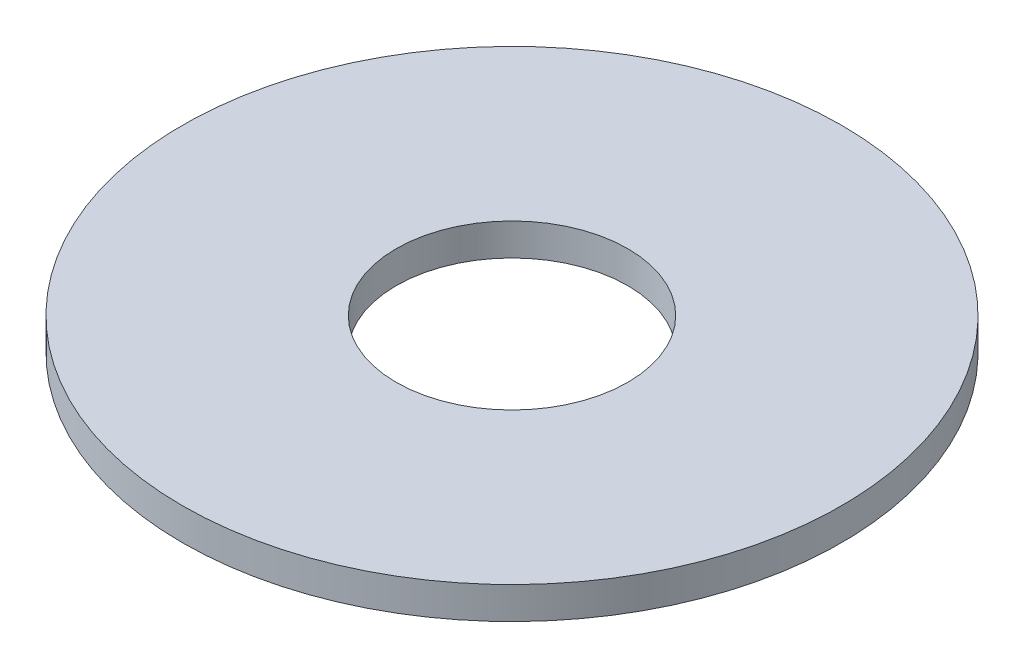
ISO-10303-21;
HEADER;
FILE_DESCRIPTION(('STEP AP214'),'2;1');
FILE_NAME('part.step','',(''),(''),'','','');
FILE_SCHEMA(('AUTOMOTIVE_DESIGN { 1 0 10303 214 1 1 1 1 }'));
ENDSEC;
DATA;
#1=APPLICATION_CONTEXT('core data for automotive mechanical design processes');
#2=APPLICATION_PROTOCOL_DEFINITION('international standard','automotive_design',2000,#1);
#3=PRODUCT_CONTEXT('',#1,'mechanical');
#4=PRODUCT('Part','Part','',(#3));
#5=PRODUCT_RELATED_PRODUCT_CATEGORY('part','',(#4));
#6=PRODUCT_DEFINITION_FORMATION('','',#4);
#7=PRODUCT_DEFINITION_CONTEXT('part definition',#1,'design');
#8=PRODUCT_DEFINITION('design','',#6,#7);
#9=PRODUCT_DEFINITION_SHAPE('','',#8);
#10=(LENGTH_UNIT() NAMED_UNIT(*) SI_UNIT(.MILLI.,.METRE.));
#11=(NAMED_UNIT(*) PLANE_ANGLE_UNIT() SI_UNIT($,.RADIAN.));
#12=(NAMED_UNIT(*) SI_UNIT($,.STERADIAN.) SOLID_ANGLE_UNIT());
#13=UNCERTAINTY_MEASURE_WITH_UNIT(LENGTH_MEASURE(1.E-05),#10,'distance_accuracy_value','');
#14=(GEOMETRIC_REPRESENTATION_CONTEXT(3) GLOBAL_UNCERTAINTY_ASSIGNED_CONTEXT((#13)) GLOBAL_UNIT_ASSIGNED_CONTEXT((#10,
#11,#12)) REPRESENTATION_CONTEXT('',''));
#15=CARTESIAN_POINT('',(0.,0.,0.));
#16=DIRECTION('',(0.,0.,1.));
#17=DIRECTION('',(1.,0.,0.));
#18=AXIS2_PLACEMENT_3D('',#15,#16,#17);
#19=CARTESIAN_POINT('',(0.,9.,0.));
#20=DIRECTION('',(0.,-1.,0.));
#21=DIRECTION('',(0.,0.,-1.));
#22=AXIS2_PLACEMENT_3D('',#19,#20,#21);
#23=CYLINDRICAL_SURFACE('',#22,92.5);
#24=CARTESIAN_POINT('',(0.,9.,0.));
#25=DIRECTION('',(0.,1.,0.));
#26=DIRECTION('',(0.,0.,1.));
#27=AXIS2_PLACEMENT_3D('',#24,#25,#26);
#28=CIRCLE('',#27,92.5);
#29=CARTESIAN_POINT('',(0.,9.,92.5));
#30=VERTEX_POINT('',#29);
#31=EDGE_CURVE('E10',#30,#30,#28,.T.);
#32=ORIENTED_EDGE('',*,*,#31,.F.);
#33=EDGE_LOOP('',(#32));
#34=FACE_BOUND('',#33,.T.);
#35=CARTESIAN_POINT('',(0.,0.,0.));
#36=DIRECTION('',(0.,1.,0.));
#37=DIRECTION('',(0.,0.,1.));
#38=AXIS2_PLACEMENT_3D('',#35,#36,#37);
#39=CIRCLE('',#38,92.5);
#40=CARTESIAN_POINT('',(0.,0.,92.5));
#41=VERTEX_POINT('',#40);
#42=EDGE_CURVE('E37',#41,#41,#39,.T.);
#43=ORIENTED_EDGE('',*,*,#42,.T.);
#44=EDGE_LOOP('',(#43));
#45=FACE_BOUND('',#44,.T.);
#46=ADVANCED_FACE('F40',(#34,#45),#23,.T.);
#47=CARTESIAN_POINT('',(0.,9.,0.));
#48=DIRECTION('',(0.,1.,0.));
#49=DIRECTION('',(0.,0.,1.));
#50=AXIS2_PLACEMENT_3D('',#47,#48,#49);
#51=PLANE('',#50);
#52=CARTESIAN_POINT('',(0.,9.,0.));
#53=DIRECTION('',(0.,1.,0.));
#54=DIRECTION('',(0.,0.,1.));
#55=AXIS2_PLACEMENT_3D('',#52,#53,#54);
#56=CIRCLE('',#55,32.5);
#57=CARTESIAN_POINT('',(0.,9.,32.5));
#58=VERTEX_POINT('',#57);
#59=EDGE_CURVE('E50',#58,#58,#56,.T.);
#60=ORIENTED_EDGE('',*,*,#59,.F.);
#61=EDGE_LOOP('',(#60));
#62=FACE_BOUND('',#61,.T.);
#63=ORIENTED_EDGE('',*,*,#31,.T.);
#64=EDGE_LOOP('',(#63));
#65=FACE_BOUND('',#64,.T.);
#66=ADVANCED_FACE('F59',(#62,#65),#51,.T.);
#67=CARTESIAN_POINT('',(0.,0.,0.));
#68=DIRECTION('',(0.,1.,0.));
#69=DIRECTION('',(0.,0.,1.));
#70=AXIS2_PLACEMENT_3D('',#67,#68,#69);
#71=PLANE('',#70);
#72=CARTESIAN_POINT('',(0.,0.,0.));
#73=DIRECTION('',(0.,1.,0.));
#74=DIRECTION('',(0.,0.,1.));
#75=AXIS2_PLACEMENT_3D('',#72,#73,#74);
#76=CIRCLE('',#75,32.5);
#77=CARTESIAN_POINT('',(0.,0.,32.5));
#78=VERTEX_POINT('',#77);
#79=EDGE_CURVE('E47',#78,#78,#76,.T.);
#80=ORIENTED_EDGE('',*,*,#79,.T.);
#81=EDGE_LOOP('',(#80));
#82=FACE_BOUND('',#81,.T.);
#83=ORIENTED_EDGE('',*,*,#42,.F.);
#84=EDGE_LOOP('',(#83));
#85=FACE_BOUND('',#84,.T.);
#86=ADVANCED_FACE('F58',(#82,#85),#71,.F.);
#87=CARTESIAN_POINT('',(0.,9.,0.));
#88=DIRECTION('',(0.,-1.,0.));
#89=DIRECTION('',(0.,0.,-1.));
#90=AXIS2_PLACEMENT_3D('',#87,#88,#89);
#91=CYLINDRICAL_SURFACE('',#90,32.5);
#92=ORIENTED_EDGE('',*,*,#59,.T.);
#93=EDGE_LOOP('',(#92));
#94=FACE_BOUND('',#93,.T.);
#95=ORIENTED_EDGE('',*,*,#79,.F.);
#96=EDGE_LOOP('',(#95));
#97=FACE_BOUND('',#96,.T.);
#98=ADVANCED_FACE('F54',(#94,#97),#91,.F.);
#99=CLOSED_SHELL('',(#46,#66,#86,#98));
#100=MANIFOLD_SOLID_BREP('B2',#99);
#101=ADVANCED_BREP_SHAPE_REPRESENTATION('',(#18,#100),#14);
#102=SHAPE_DEFINITION_REPRESENTATION(#9,#101);
ENDSEC;
END-ISO-10303-21;
